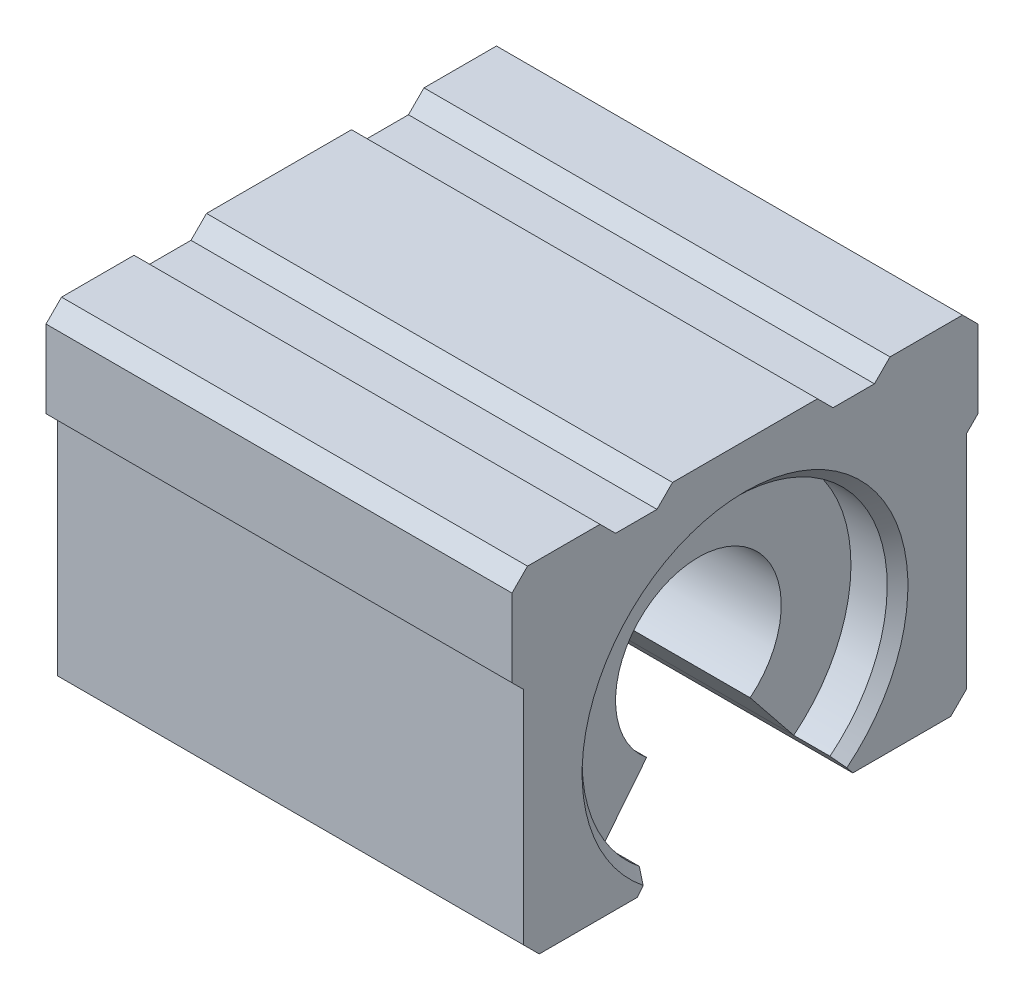
ISO-10303-21;
HEADER;
FILE_DESCRIPTION(('STEP AP214'),'2;1');
FILE_NAME('part.step','',(''),(''),'','','');
FILE_SCHEMA(('AUTOMOTIVE_DESIGN { 1 0 10303 214 1 1 1 1 }'));
ENDSEC;
DATA;
#1=APPLICATION_CONTEXT('core data for automotive mechanical design processes');
#2=APPLICATION_PROTOCOL_DEFINITION('international standard','automotive_design',2000,#1);
#3=PRODUCT_CONTEXT('',#1,'mechanical');
#4=PRODUCT('Part','Part','',(#3));
#5=PRODUCT_RELATED_PRODUCT_CATEGORY('part','',(#4));
#6=PRODUCT_DEFINITION_FORMATION('','',#4);
#7=PRODUCT_DEFINITION_CONTEXT('part definition',#1,'design');
#8=PRODUCT_DEFINITION('design','',#6,#7);
#9=PRODUCT_DEFINITION_SHAPE('','',#8);
#10=(LENGTH_UNIT() NAMED_UNIT(*) SI_UNIT(.MILLI.,.METRE.));
#11=(NAMED_UNIT(*) PLANE_ANGLE_UNIT() SI_UNIT($,.RADIAN.));
#12=(NAMED_UNIT(*) SI_UNIT($,.STERADIAN.) SOLID_ANGLE_UNIT());
#13=UNCERTAINTY_MEASURE_WITH_UNIT(LENGTH_MEASURE(1.E-05),#10,'distance_accuracy_value','');
#14=(GEOMETRIC_REPRESENTATION_CONTEXT(3) GLOBAL_UNCERTAINTY_ASSIGNED_CONTEXT((#13)) GLOBAL_UNIT_ASSIGNED_CONTEXT((#10,
#11,#12)) REPRESENTATION_CONTEXT('',''));
#15=CARTESIAN_POINT('',(0.,0.,0.));
#16=DIRECTION('',(0.,0.,1.));
#17=DIRECTION('',(1.,0.,0.));
#18=AXIS2_PLACEMENT_3D('',#15,#16,#17);
#19=CARTESIAN_POINT('',(40.5,0.,0.));
#20=DIRECTION('',(1.,0.,0.));
#21=DIRECTION('',(0.,0.,-1.));
#22=AXIS2_PLACEMENT_3D('',#19,#20,#21);
#23=PLANE('',#22);
#24=CARTESIAN_POINT('',(40.5,0.,0.));
#25=DIRECTION('',(1.,0.,0.));
#26=DIRECTION('',(0.,0.,-1.));
#27=AXIS2_PLACEMENT_3D('',#24,#25,#26);
#28=CIRCLE('',#27,8.);
#29=CARTESIAN_POINT('',(40.5,-6.2449979983984,5.));
#30=VERTEX_POINT('',#29);
#31=CARTESIAN_POINT('',(40.5,-6.24984510039076,-4.99393994969118));
#32=VERTEX_POINT('',#31);
#33=EDGE_CURVE('E60',#30,#32,#28,.F.);
#34=ORIENTED_EDGE('',*,*,#33,.T.);
#35=DIRECTION('',(0.,-0.779903763932189,-0.625899447998162));
#36=VECTOR('',#35,1.);
#37=CARTESIAN_POINT('',(40.5,-0.0106290462028952,0.0132443528543765));
#38=LINE('',#37,#36);
#39=CARTESIAN_POINT('',(40.5,-11.5,-9.20736884379251));
#40=VERTEX_POINT('',#39);
#41=EDGE_CURVE('E554',#32,#40,#38,.T.);
#42=ORIENTED_EDGE('',*,*,#41,.T.);
#43=CARTESIAN_POINT('',(40.5,0.,0.));
#44=DIRECTION('',(1.,0.,0.));
#45=DIRECTION('',(0.,0.,-1.));
#46=AXIS2_PLACEMENT_3D('',#43,#44,#45);
#47=CIRCLE('',#46,14.731790150068);
#48=CARTESIAN_POINT('',(40.5,-11.5,9.20736884379251));
#49=VERTEX_POINT('',#48);
#50=EDGE_CURVE('E265',#40,#49,#47,.T.);
#51=ORIENTED_EDGE('',*,*,#50,.T.);
#52=DIRECTION('',(0.,0.7806247497998,-0.625));
#53=VECTOR('',#52,1.);
#54=CARTESIAN_POINT('',(40.5,0.,0.));
#55=LINE('',#54,#53);
#56=EDGE_CURVE('E253',#49,#30,#55,.T.);
#57=ORIENTED_EDGE('',*,*,#56,.T.);
#58=EDGE_LOOP('',(#34,#42,#51,#57));
#59=FACE_BOUND('',#58,.T.);
#60=ADVANCED_FACE('F43',(#59),#23,.T.);
#61=CARTESIAN_POINT('',(45.,18.5,22.5));
#62=DIRECTION('',(0.,0.707106781186547,0.707106781186547));
#63=DIRECTION('',(0.,-0.707106781186548,0.707106781186548));
#64=AXIS2_PLACEMENT_3D('',#61,#62,#63);
#65=PLANE('',#64);
#66=DIRECTION('',(0.,0.707106781186547,-0.707106781186547));
#67=VECTOR('',#66,1.);
#68=CARTESIAN_POINT('',(0.,18.5,22.5));
#69=LINE('',#68,#67);
#70=CARTESIAN_POINT('',(0.,18.5,22.5));
#71=VERTEX_POINT('',#70);
#72=CARTESIAN_POINT('',(0.,20.,21.));
#73=VERTEX_POINT('',#72);
#74=EDGE_CURVE('E270',#71,#73,#69,.T.);
#75=ORIENTED_EDGE('',*,*,#74,.F.);
#76=DIRECTION('',(-1.,0.,0.));
#77=VECTOR('',#76,1.);
#78=CARTESIAN_POINT('',(45.,18.5,22.5));
#79=LINE('',#78,#77);
#80=CARTESIAN_POINT('',(45.,18.5,22.5));
#81=VERTEX_POINT('',#80);
#82=EDGE_CURVE('E447',#81,#71,#79,.T.);
#83=ORIENTED_EDGE('',*,*,#82,.F.);
#84=DIRECTION('',(0.,0.707106781186547,-0.707106781186547));
#85=VECTOR('',#84,1.);
#86=CARTESIAN_POINT('',(45.,18.5,22.5));
#87=LINE('',#86,#85);
#88=CARTESIAN_POINT('',(45.,20.,21.));
#89=VERTEX_POINT('',#88);
#90=EDGE_CURVE('E280',#81,#89,#87,.T.);
#91=ORIENTED_EDGE('',*,*,#90,.T.);
#92=DIRECTION('',(-1.,0.,0.));
#93=VECTOR('',#92,1.);
#94=CARTESIAN_POINT('',(45.,20.,21.));
#95=LINE('',#94,#93);
#96=EDGE_CURVE('E364',#89,#73,#95,.T.);
#97=ORIENTED_EDGE('',*,*,#96,.T.);
#98=EDGE_LOOP('',(#75,#83,#91,#97));
#99=FACE_BOUND('',#98,.T.);
#100=ADVANCED_FACE('F589',(#99),#65,.T.);
#101=CARTESIAN_POINT('',(45.,18.5,22.5));
#102=DIRECTION('',(0.,0.,-1.));
#103=DIRECTION('',(-1.,0.,0.));
#104=AXIS2_PLACEMENT_3D('',#101,#102,#103);
#105=PLANE('',#104);
#106=DIRECTION('',(0.,-1.,0.));
#107=VECTOR('',#106,1.);
#108=CARTESIAN_POINT('',(0.,18.5,22.5));
#109=LINE('',#108,#107);
#110=CARTESIAN_POINT('',(0.,11.,22.5));
#111=VERTEX_POINT('',#110);
#112=EDGE_CURVE('E285',#71,#111,#109,.T.);
#113=ORIENTED_EDGE('',*,*,#112,.T.);
#114=DIRECTION('',(-1.,0.,0.));
#115=VECTOR('',#114,1.);
#116=CARTESIAN_POINT('',(45.,11.,22.5));
#117=LINE('',#116,#115);
#118=CARTESIAN_POINT('',(45.,11.,22.5));
#119=VERTEX_POINT('',#118);
#120=EDGE_CURVE('E451',#119,#111,#117,.T.);
#121=ORIENTED_EDGE('',*,*,#120,.F.);
#122=DIRECTION('',(0.,-1.,0.));
#123=VECTOR('',#122,1.);
#124=CARTESIAN_POINT('',(45.,18.5,22.5));
#125=LINE('',#124,#123);
#126=EDGE_CURVE('E362',#81,#119,#125,.T.);
#127=ORIENTED_EDGE('',*,*,#126,.F.);
#128=ORIENTED_EDGE('',*,*,#82,.T.);
#129=EDGE_LOOP('',(#113,#121,#127,#128));
#130=FACE_BOUND('',#129,.T.);
#131=ADVANCED_FACE('F593',(#130),#105,.F.);
#132=CARTESIAN_POINT('',(45.,11.,22.5));
#133=DIRECTION('',(0.,0.707106781186556,-0.707106781186539));
#134=DIRECTION('',(0.,0.707106781186539,0.707106781186556));
#135=AXIS2_PLACEMENT_3D('',#132,#133,#134);
#136=PLANE('',#135);
#137=DIRECTION('',(0.,-0.707106781186539,-0.707106781186556));
#138=VECTOR('',#137,1.);
#139=CARTESIAN_POINT('',(0.,11.,22.5));
#140=LINE('',#139,#138);
#141=CARTESIAN_POINT('',(0.,9.86862915010154,21.3686291501015));
#142=VERTEX_POINT('',#141);
#143=EDGE_CURVE('E442',#111,#142,#140,.T.);
#144=ORIENTED_EDGE('',*,*,#143,.T.);
#145=DIRECTION('',(-1.,0.,0.));
#146=VECTOR('',#145,1.);
#147=CARTESIAN_POINT('',(45.,9.86862915010154,21.3686291501015));
#148=LINE('',#147,#146);
#149=CARTESIAN_POINT('',(45.,9.86862915010154,21.3686291501015));
#150=VERTEX_POINT('',#149);
#151=EDGE_CURVE('E455',#150,#142,#148,.T.);
#152=ORIENTED_EDGE('',*,*,#151,.F.);
#153=DIRECTION('',(0.,-0.707106781186539,-0.707106781186556));
#154=VECTOR('',#153,1.);
#155=CARTESIAN_POINT('',(45.,11.,22.5));
#156=LINE('',#155,#154);
#157=EDGE_CURVE('E359',#119,#150,#156,.T.);
#158=ORIENTED_EDGE('',*,*,#157,.F.);
#159=ORIENTED_EDGE('',*,*,#120,.T.);
#160=EDGE_LOOP('',(#144,#152,#158,#159));
#161=FACE_BOUND('',#160,.T.);
#162=ADVANCED_FACE('F615',(#161),#136,.F.);
#163=CARTESIAN_POINT('',(45.,9.86862915010154,21.3686291501015));
#164=DIRECTION('',(0.,0.,-1.));
#165=DIRECTION('',(-1.,0.,0.));
#166=AXIS2_PLACEMENT_3D('',#163,#164,#165);
#167=PLANE('',#166);
#168=DIRECTION('',(0.,-1.,0.));
#169=VECTOR('',#168,1.);
#170=CARTESIAN_POINT('',(0.,9.86862915010154,21.3686291501015));
#171=LINE('',#170,#169);
#172=CARTESIAN_POINT('',(0.,-11.5,21.3686291501015));
#173=VERTEX_POINT('',#172);
#174=EDGE_CURVE('E439',#142,#173,#171,.T.);
#175=ORIENTED_EDGE('',*,*,#174,.T.);
#176=DIRECTION('',(-1.,0.,0.));
#177=VECTOR('',#176,1.);
#178=CARTESIAN_POINT('',(45.,-11.5,21.3686291501015));
#179=LINE('',#178,#177);
#180=CARTESIAN_POINT('',(45.,-11.5,21.3686291501015));
#181=VERTEX_POINT('',#180);
#182=EDGE_CURVE('E459',#181,#173,#179,.T.);
#183=ORIENTED_EDGE('',*,*,#182,.F.);
#184=DIRECTION('',(0.,-1.,0.));
#185=VECTOR('',#184,1.);
#186=CARTESIAN_POINT('',(45.,9.86862915010154,21.3686291501015));
#187=LINE('',#186,#185);
#188=EDGE_CURVE('E356',#150,#181,#187,.T.);
#189=ORIENTED_EDGE('',*,*,#188,.F.);
#190=ORIENTED_EDGE('',*,*,#151,.T.);
#191=EDGE_LOOP('',(#175,#183,#189,#190));
#192=FACE_BOUND('',#191,.T.);
#193=ADVANCED_FACE('F619',(#192),#167,.F.);
#194=CARTESIAN_POINT('',(45.,-11.5,21.3686291501015));
#195=DIRECTION('',(0.,0.707106781186548,-0.707106781186547));
#196=DIRECTION('',(0.,0.707106781186547,0.707106781186548));
#197=AXIS2_PLACEMENT_3D('',#194,#195,#196);
#198=PLANE('',#197);
#199=DIRECTION('',(0.,-0.707106781186547,-0.707106781186548));
#200=VECTOR('',#199,1.);
#201=CARTESIAN_POINT('',(0.,-11.5,21.3686291501015));
#202=LINE('',#201,#200);
#203=CARTESIAN_POINT('',(0.,-13.,19.8686291501015));
#204=VERTEX_POINT('',#203);
#205=EDGE_CURVE('E435',#173,#204,#202,.T.);
#206=ORIENTED_EDGE('',*,*,#205,.T.);
#207=DIRECTION('',(-1.,0.,0.));
#208=VECTOR('',#207,1.);
#209=CARTESIAN_POINT('',(45.,-13.,19.8686291501015));
#210=LINE('',#209,#208);
#211=CARTESIAN_POINT('',(45.,-13.,19.8686291501015));
#212=VERTEX_POINT('',#211);
#213=EDGE_CURVE('E463',#212,#204,#210,.T.);
#214=ORIENTED_EDGE('',*,*,#213,.F.);
#215=DIRECTION('',(0.,-0.707106781186547,-0.707106781186548));
#216=VECTOR('',#215,1.);
#217=CARTESIAN_POINT('',(45.,-11.5,21.3686291501015));
#218=LINE('',#217,#216);
#219=EDGE_CURVE('E353',#181,#212,#218,.T.);
#220=ORIENTED_EDGE('',*,*,#219,.F.);
#221=ORIENTED_EDGE('',*,*,#182,.T.);
#222=EDGE_LOOP('',(#206,#214,#220,#221));
#223=FACE_BOUND('',#222,.T.);
#224=ADVANCED_FACE('F623',(#223),#198,.F.);
#225=CARTESIAN_POINT('',(45.,-13.,10.4083299973307));
#226=DIRECTION('',(0.,-1.,0.));
#227=DIRECTION('',(0.,0.,-1.));
#228=AXIS2_PLACEMENT_3D('',#225,#226,#227);
#229=PLANE('',#228);
#230=DIRECTION('',(0.,0.,1.));
#231=VECTOR('',#230,1.);
#232=CARTESIAN_POINT('',(0.,-13.,10.4083299973307));
#233=LINE('',#232,#231);
#234=CARTESIAN_POINT('',(0.,-13.,10.4083299973307));
#235=VERTEX_POINT('',#234);
#236=EDGE_CURVE('E431',#235,#204,#233,.T.);
#237=ORIENTED_EDGE('',*,*,#236,.F.);
#238=DIRECTION('',(-1.,0.,0.));
#239=VECTOR('',#238,1.);
#240=CARTESIAN_POINT('',(45.,-13.,10.4083299973307));
#241=LINE('',#240,#239);
#242=CARTESIAN_POINT('',(45.,-13.,10.4083299973307));
#243=VERTEX_POINT('',#242);
#244=EDGE_CURVE('E466',#243,#235,#241,.T.);
#245=ORIENTED_EDGE('',*,*,#244,.F.);
#246=DIRECTION('',(0.,0.,1.));
#247=VECTOR('',#246,1.);
#248=CARTESIAN_POINT('',(45.,-13.,10.4083299973307));
#249=LINE('',#248,#247);
#250=EDGE_CURVE('E349',#243,#212,#249,.T.);
#251=ORIENTED_EDGE('',*,*,#250,.T.);
#252=ORIENTED_EDGE('',*,*,#213,.T.);
#253=EDGE_LOOP('',(#237,#245,#251,#252));
#254=FACE_BOUND('',#253,.T.);
#255=ADVANCED_FACE('F627',(#254),#229,.T.);
#256=CARTESIAN_POINT('',(45.,-13.,10.4083299973307));
#257=DIRECTION('',(0.,0.625,0.7806247497998));
#258=DIRECTION('',(0.,-0.7806247497998,0.625));
#259=AXIS2_PLACEMENT_3D('',#256,#257,#258);
#260=PLANE('',#259);
#261=DIRECTION('',(0.,0.7806247497998,-0.625));
#262=VECTOR('',#261,1.);
#263=CARTESIAN_POINT('',(0.,-13.,10.4083299973307));
#264=LINE('',#263,#262);
#265=CARTESIAN_POINT('',(0.,-12.2806247497998,9.83236884379252));
#266=VERTEX_POINT('',#265);
#267=EDGE_CURVE('E428',#235,#266,#264,.T.);
#268=ORIENTED_EDGE('',*,*,#267,.T.);
#269=DIRECTION('',(0.707106781186548,0.55198505414549,-0.441941738241592));
#270=VECTOR('',#269,1.);
#271=CARTESIAN_POINT('',(15.7317901500681,0.,0.));
#272=LINE('',#271,#270);
#273=CARTESIAN_POINT('',(1.00000000000001,-11.5,9.20736884379251));
#274=VERTEX_POINT('',#273);
#275=EDGE_CURVE('E11',#266,#274,#272,.T.);
#276=ORIENTED_EDGE('',*,*,#275,.T.);
#277=DIRECTION('',(-1.,0.,0.));
#278=VECTOR('',#277,1.);
#279=CARTESIAN_POINT('',(4.5,-11.5,9.20736884379251));
#280=LINE('',#279,#278);
#281=CARTESIAN_POINT('',(4.5,-11.5,9.20736884379251));
#282=VERTEX_POINT('',#281);
#283=EDGE_CURVE('E260',#282,#274,#280,.T.);
#284=ORIENTED_EDGE('',*,*,#283,.F.);
#285=DIRECTION('',(0.,0.7806247497998,-0.625));
#286=VECTOR('',#285,1.);
#287=CARTESIAN_POINT('',(4.5,0.,0.));
#288=LINE('',#287,#286);
#289=CARTESIAN_POINT('',(4.5,-6.2449979983984,5.));
#290=VERTEX_POINT('',#289);
#291=EDGE_CURVE('E243',#282,#290,#288,.T.);
#292=ORIENTED_EDGE('',*,*,#291,.T.);
#293=DIRECTION('',(1.,0.,0.));
#294=VECTOR('',#293,1.);
#295=CARTESIAN_POINT('',(-22.3207487610351,-6.2449979983984,5.));
#296=LINE('',#295,#294);
#297=EDGE_CURVE('E569',#290,#30,#296,.T.);
#298=ORIENTED_EDGE('',*,*,#297,.T.);
#299=ORIENTED_EDGE('',*,*,#56,.F.);
#300=DIRECTION('',(-1.,0.,0.));
#301=VECTOR('',#300,1.);
#302=CARTESIAN_POINT('',(45.,-11.5,9.20736884379251));
#303=LINE('',#302,#301);
#304=CARTESIAN_POINT('',(44.,-11.5,9.20736884379251));
#305=VERTEX_POINT('',#304);
#306=EDGE_CURVE('E469',#305,#49,#303,.T.);
#307=ORIENTED_EDGE('',*,*,#306,.F.);
#308=DIRECTION('',(0.707106781186542,-0.551985054145495,0.441941738241596));
#309=VECTOR('',#308,1.);
#310=CARTESIAN_POINT('',(29.2682098499322,0.,0.));
#311=LINE('',#310,#309);
#312=CARTESIAN_POINT('',(45.,-12.2806247497998,9.83236884379251));
#313=VERTEX_POINT('',#312);
#314=EDGE_CURVE('E529',#305,#313,#311,.T.);
#315=ORIENTED_EDGE('',*,*,#314,.T.);
#316=DIRECTION('',(0.,0.7806247497998,-0.625));
#317=VECTOR('',#316,1.);
#318=CARTESIAN_POINT('',(45.,-13.,10.4083299973307));
#319=LINE('',#318,#317);
#320=EDGE_CURVE('E345',#243,#313,#319,.T.);
#321=ORIENTED_EDGE('',*,*,#320,.F.);
#322=ORIENTED_EDGE('',*,*,#244,.T.);
#323=EDGE_LOOP('',(#268,#276,#284,#292,#298,#299,#307,#315,#321,#322));
#324=FACE_BOUND('',#323,.T.);
#325=ADVANCED_FACE('F267',(#324),#260,.F.);
#326=CARTESIAN_POINT('',(45.,-11.5,-9.20736884379251));
#327=DIRECTION('',(0.,0.625,-0.7806247497998));
#328=DIRECTION('',(0.,0.7806247497998,0.625));
#329=AXIS2_PLACEMENT_3D('',#326,#327,#328);
#330=PLANE('',#329);
#331=DIRECTION('',(-1.,0.,0.));
#332=VECTOR('',#331,1.);
#333=CARTESIAN_POINT('',(4.5,-11.5,-9.20736884379251));
#334=LINE('',#333,#332);
#335=CARTESIAN_POINT('',(4.5,-11.5,-9.20736884379251));
#336=VERTEX_POINT('',#335);
#337=CARTESIAN_POINT('',(1.00000000000001,-11.5,-9.20736884379251));
#338=VERTEX_POINT('',#337);
#339=EDGE_CURVE('E263',#336,#338,#334,.T.);
#340=ORIENTED_EDGE('',*,*,#339,.T.);
#341=DIRECTION('',(-0.707106781186548,-0.55198505414549,-0.441941738241592));
#342=VECTOR('',#341,1.);
#343=CARTESIAN_POINT('',(15.7317901500681,0.,0.));
#344=LINE('',#343,#342);
#345=CARTESIAN_POINT('',(0.,-12.2806247497998,-9.83236884379252));
#346=VERTEX_POINT('',#345);
#347=EDGE_CURVE('E541',#338,#346,#344,.T.);
#348=ORIENTED_EDGE('',*,*,#347,.T.);
#349=DIRECTION('',(0.,-0.7806247497998,-0.625));
#350=VECTOR('',#349,1.);
#351=CARTESIAN_POINT('',(0.,-11.5,-9.20736884379251));
#352=LINE('',#351,#350);
#353=CARTESIAN_POINT('',(0.,-13.,-10.4083299973307));
#354=VERTEX_POINT('',#353);
#355=EDGE_CURVE('E425',#346,#354,#352,.T.);
#356=ORIENTED_EDGE('',*,*,#355,.T.);
#357=DIRECTION('',(-1.,0.,0.));
#358=VECTOR('',#357,1.);
#359=CARTESIAN_POINT('',(45.,-13.,-10.4083299973307));
#360=LINE('',#359,#358);
#361=CARTESIAN_POINT('',(45.,-13.,-10.4083299973307));
#362=VERTEX_POINT('',#361);
#363=EDGE_CURVE('E478',#362,#354,#360,.T.);
#364=ORIENTED_EDGE('',*,*,#363,.F.);
#365=DIRECTION('',(0.,-0.7806247497998,-0.625));
#366=VECTOR('',#365,1.);
#367=CARTESIAN_POINT('',(45.,-11.5,-9.20736884379251));
#368=LINE('',#367,#366);
#369=CARTESIAN_POINT('',(45.,-12.2806247497998,-9.83236884379251));
#370=VERTEX_POINT('',#369);
#371=EDGE_CURVE('E342',#370,#362,#368,.T.);
#372=ORIENTED_EDGE('',*,*,#371,.F.);
#373=DIRECTION('',(-0.707106781186542,0.551985054145495,0.441941738241596));
#374=VECTOR('',#373,1.);
#375=CARTESIAN_POINT('',(29.2682098499322,0.,0.));
#376=LINE('',#375,#374);
#377=CARTESIAN_POINT('',(44.,-11.5,-9.20736884379251));
#378=VERTEX_POINT('',#377);
#379=EDGE_CURVE('E535',#370,#378,#376,.T.);
#380=ORIENTED_EDGE('',*,*,#379,.T.);
#381=DIRECTION('',(-1.,0.,0.));
#382=VECTOR('',#381,1.);
#383=CARTESIAN_POINT('',(45.,-11.5,-9.20736884379251));
#384=LINE('',#383,#382);
#385=EDGE_CURVE('E473',#378,#40,#384,.T.);
#386=ORIENTED_EDGE('',*,*,#385,.T.);
#387=EDGE_CURVE('E477',#40,#336,#384,.T.);
#388=ORIENTED_EDGE('',*,*,#387,.T.);
#389=EDGE_LOOP('',(#340,#348,#356,#364,#372,#380,#386,#388));
#390=FACE_BOUND('',#389,.T.);
#391=ADVANCED_FACE('F547',(#390),#330,.F.);
#392=CARTESIAN_POINT('',(45.,-13.,-19.8686291501015));
#393=DIRECTION('',(0.,-1.,0.));
#394=DIRECTION('',(0.,0.,-1.));
#395=AXIS2_PLACEMENT_3D('',#392,#393,#394);
#396=PLANE('',#395);
#397=DIRECTION('',(0.,0.,1.));
#398=VECTOR('',#397,1.);
#399=CARTESIAN_POINT('',(0.,-13.,-19.8686291501015));
#400=LINE('',#399,#398);
#401=CARTESIAN_POINT('',(0.,-13.,-19.8686291501015));
#402=VERTEX_POINT('',#401);
#403=EDGE_CURVE('E421',#402,#354,#400,.T.);
#404=ORIENTED_EDGE('',*,*,#403,.F.);
#405=DIRECTION('',(-1.,0.,0.));
#406=VECTOR('',#405,1.);
#407=CARTESIAN_POINT('',(45.,-13.,-19.8686291501015));
#408=LINE('',#407,#406);
#409=CARTESIAN_POINT('',(45.,-13.,-19.8686291501015));
#410=VERTEX_POINT('',#409);
#411=EDGE_CURVE('E482',#410,#402,#408,.T.);
#412=ORIENTED_EDGE('',*,*,#411,.F.);
#413=DIRECTION('',(0.,0.,1.));
#414=VECTOR('',#413,1.);
#415=CARTESIAN_POINT('',(45.,-13.,-19.8686291501015));
#416=LINE('',#415,#414);
#417=EDGE_CURVE('E338',#410,#362,#416,.T.);
#418=ORIENTED_EDGE('',*,*,#417,.T.);
#419=ORIENTED_EDGE('',*,*,#363,.T.);
#420=EDGE_LOOP('',(#404,#412,#418,#419));
#421=FACE_BOUND('',#420,.T.);
#422=ADVANCED_FACE('F636',(#421),#396,.T.);
#423=CARTESIAN_POINT('',(45.,-11.5,-21.3686291501015));
#424=DIRECTION('',(0.,-0.707106781186548,-0.707106781186547));
#425=DIRECTION('',(0.,0.707106781186547,-0.707106781186548));
#426=AXIS2_PLACEMENT_3D('',#423,#424,#425);
#427=PLANE('',#426);
#428=DIRECTION('',(0.,-0.707106781186547,0.707106781186548));
#429=VECTOR('',#428,1.);
#430=CARTESIAN_POINT('',(0.,-11.5,-21.3686291501015));
#431=LINE('',#430,#429);
#432=CARTESIAN_POINT('',(0.,-11.5,-21.3686291501015));
#433=VERTEX_POINT('',#432);
#434=EDGE_CURVE('E417',#433,#402,#431,.T.);
#435=ORIENTED_EDGE('',*,*,#434,.F.);
#436=DIRECTION('',(-1.,0.,0.));
#437=VECTOR('',#436,1.);
#438=CARTESIAN_POINT('',(45.,-11.5,-21.3686291501015));
#439=LINE('',#438,#437);
#440=CARTESIAN_POINT('',(45.,-11.5,-21.3686291501015));
#441=VERTEX_POINT('',#440);
#442=EDGE_CURVE('E485',#441,#433,#439,.T.);
#443=ORIENTED_EDGE('',*,*,#442,.F.);
#444=DIRECTION('',(0.,-0.707106781186547,0.707106781186548));
#445=VECTOR('',#444,1.);
#446=CARTESIAN_POINT('',(45.,-11.5,-21.3686291501015));
#447=LINE('',#446,#445);
#448=EDGE_CURVE('E334',#441,#410,#447,.T.);
#449=ORIENTED_EDGE('',*,*,#448,.T.);
#450=ORIENTED_EDGE('',*,*,#411,.T.);
#451=EDGE_LOOP('',(#435,#443,#449,#450));
#452=FACE_BOUND('',#451,.T.);
#453=ADVANCED_FACE('F639',(#452),#427,.T.);
#454=CARTESIAN_POINT('',(45.,9.86862915010154,-21.3686291501016));
#455=DIRECTION('',(0.,0.,-1.));
#456=DIRECTION('',(0.,1.,0.));
#457=AXIS2_PLACEMENT_3D('',#454,#455,#456);
#458=PLANE('',#457);
#459=DIRECTION('',(0.,-1.,0.));
#460=VECTOR('',#459,1.);
#461=CARTESIAN_POINT('',(0.,9.86862915010154,-21.3686291501016));
#462=LINE('',#461,#460);
#463=CARTESIAN_POINT('',(0.,9.86862915010154,-21.3686291501016));
#464=VERTEX_POINT('',#463);
#465=EDGE_CURVE('E413',#464,#433,#462,.T.);
#466=ORIENTED_EDGE('',*,*,#465,.F.);
#467=DIRECTION('',(-1.,0.,0.));
#468=VECTOR('',#467,1.);
#469=CARTESIAN_POINT('',(45.,9.86862915010154,-21.3686291501016));
#470=LINE('',#469,#468);
#471=CARTESIAN_POINT('',(45.,9.86862915010154,-21.3686291501016));
#472=VERTEX_POINT('',#471);
#473=EDGE_CURVE('E488',#472,#464,#470,.T.);
#474=ORIENTED_EDGE('',*,*,#473,.F.);
#475=DIRECTION('',(0.,-1.,0.));
#476=VECTOR('',#475,1.);
#477=CARTESIAN_POINT('',(45.,9.86862915010154,-21.3686291501016));
#478=LINE('',#477,#476);
#479=EDGE_CURVE('E330',#472,#441,#478,.T.);
#480=ORIENTED_EDGE('',*,*,#479,.T.);
#481=ORIENTED_EDGE('',*,*,#442,.T.);
#482=EDGE_LOOP('',(#466,#474,#480,#481));
#483=FACE_BOUND('',#482,.T.);
#484=ADVANCED_FACE('F643',(#483),#458,.T.);
#485=CARTESIAN_POINT('',(45.,11.,-22.5));
#486=DIRECTION('',(0.,-0.707106781186542,-0.707106781186553));
#487=DIRECTION('',(0.,0.707106781186553,-0.707106781186542));
#488=AXIS2_PLACEMENT_3D('',#485,#486,#487);
#489=PLANE('',#488);
#490=DIRECTION('',(0.,-0.707106781186553,0.707106781186542));
#491=VECTOR('',#490,1.);
#492=CARTESIAN_POINT('',(0.,11.,-22.5));
#493=LINE('',#492,#491);
#494=CARTESIAN_POINT('',(0.,11.,-22.5));
#495=VERTEX_POINT('',#494);
#496=EDGE_CURVE('E409',#495,#464,#493,.T.);
#497=ORIENTED_EDGE('',*,*,#496,.F.);
#498=DIRECTION('',(-1.,0.,0.));
#499=VECTOR('',#498,1.);
#500=CARTESIAN_POINT('',(45.,11.,-22.5));
#501=LINE('',#500,#499);
#502=CARTESIAN_POINT('',(45.,11.,-22.5));
#503=VERTEX_POINT('',#502);
#504=EDGE_CURVE('E491',#503,#495,#501,.T.);
#505=ORIENTED_EDGE('',*,*,#504,.F.);
#506=DIRECTION('',(0.,-0.707106781186553,0.707106781186542));
#507=VECTOR('',#506,1.);
#508=CARTESIAN_POINT('',(45.,11.,-22.5));
#509=LINE('',#508,#507);
#510=EDGE_CURVE('E326',#503,#472,#509,.T.);
#511=ORIENTED_EDGE('',*,*,#510,.T.);
#512=ORIENTED_EDGE('',*,*,#473,.T.);
#513=EDGE_LOOP('',(#497,#505,#511,#512));
#514=FACE_BOUND('',#513,.T.);
#515=ADVANCED_FACE('F647',(#514),#489,.T.);
#516=CARTESIAN_POINT('',(45.,18.5,-22.5));
#517=DIRECTION('',(0.,0.,-1.));
#518=DIRECTION('',(-1.,0.,0.));
#519=AXIS2_PLACEMENT_3D('',#516,#517,#518);
#520=PLANE('',#519);
#521=DIRECTION('',(0.,-1.,0.));
#522=VECTOR('',#521,1.);
#523=CARTESIAN_POINT('',(0.,18.5,-22.5));
#524=LINE('',#523,#522);
#525=CARTESIAN_POINT('',(0.,18.5,-22.5));
#526=VERTEX_POINT('',#525);
#527=EDGE_CURVE('E405',#526,#495,#524,.T.);
#528=ORIENTED_EDGE('',*,*,#527,.F.);
#529=DIRECTION('',(-1.,0.,0.));
#530=VECTOR('',#529,1.);
#531=CARTESIAN_POINT('',(45.,18.5,-22.5));
#532=LINE('',#531,#530);
#533=CARTESIAN_POINT('',(45.,18.5,-22.5));
#534=VERTEX_POINT('',#533);
#535=EDGE_CURVE('E494',#534,#526,#532,.T.);
#536=ORIENTED_EDGE('',*,*,#535,.F.);
#537=DIRECTION('',(0.,-1.,0.));
#538=VECTOR('',#537,1.);
#539=CARTESIAN_POINT('',(45.,18.5,-22.5));
#540=LINE('',#539,#538);
#541=EDGE_CURVE('E322',#534,#503,#540,.T.);
#542=ORIENTED_EDGE('',*,*,#541,.T.);
#543=ORIENTED_EDGE('',*,*,#504,.T.);
#544=EDGE_LOOP('',(#528,#536,#542,#543));
#545=FACE_BOUND('',#544,.T.);
#546=ADVANCED_FACE('F651',(#545),#520,.T.);
#547=CARTESIAN_POINT('',(45.,18.5,-22.5));
#548=DIRECTION('',(0.,-0.707106781186547,0.707106781186547));
#549=DIRECTION('',(0.,-0.707106781186548,-0.707106781186548));
#550=AXIS2_PLACEMENT_3D('',#547,#548,#549);
#551=PLANE('',#550);
#552=DIRECTION('',(0.,0.707106781186547,0.707106781186547));
#553=VECTOR('',#552,1.);
#554=CARTESIAN_POINT('',(0.,18.5,-22.5));
#555=LINE('',#554,#553);
#556=CARTESIAN_POINT('',(0.,20.,-21.));
#557=VERTEX_POINT('',#556);
#558=EDGE_CURVE('E401',#526,#557,#555,.T.);
#559=ORIENTED_EDGE('',*,*,#558,.T.);
#560=DIRECTION('',(-1.,0.,0.));
#561=VECTOR('',#560,1.);
#562=CARTESIAN_POINT('',(45.,20.,-21.));
#563=LINE('',#562,#561);
#564=CARTESIAN_POINT('',(45.,20.,-21.));
#565=VERTEX_POINT('',#564);
#566=EDGE_CURVE('E497',#565,#557,#563,.T.);
#567=ORIENTED_EDGE('',*,*,#566,.F.);
#568=DIRECTION('',(0.,0.707106781186547,0.707106781186547));
#569=VECTOR('',#568,1.);
#570=CARTESIAN_POINT('',(45.,18.5,-22.5));
#571=LINE('',#570,#569);
#572=EDGE_CURVE('E319',#534,#565,#571,.T.);
#573=ORIENTED_EDGE('',*,*,#572,.F.);
#574=ORIENTED_EDGE('',*,*,#535,.T.);
#575=EDGE_LOOP('',(#559,#567,#573,#574));
#576=FACE_BOUND('',#575,.T.);
#577=ADVANCED_FACE('F655',(#576),#551,.F.);
#578=CARTESIAN_POINT('',(45.,20.,-14.));
#579=DIRECTION('',(0.,1.,0.));
#580=DIRECTION('',(0.,0.,1.));
#581=AXIS2_PLACEMENT_3D('',#578,#579,#580);
#582=PLANE('',#581);
#583=DIRECTION('',(0.,0.,-1.));
#584=VECTOR('',#583,1.);
#585=CARTESIAN_POINT('',(0.,20.,-14.));
#586=LINE('',#585,#584);
#587=CARTESIAN_POINT('',(0.,20.,-14.));
#588=VERTEX_POINT('',#587);
#589=EDGE_CURVE('E397',#588,#557,#586,.T.);
#590=ORIENTED_EDGE('',*,*,#589,.F.);
#591=DIRECTION('',(-1.,0.,0.));
#592=VECTOR('',#591,1.);
#593=CARTESIAN_POINT('',(45.,20.,-14.));
#594=LINE('',#593,#592);
#595=CARTESIAN_POINT('',(45.,20.,-14.));
#596=VERTEX_POINT('',#595);
#597=EDGE_CURVE('E500',#596,#588,#594,.T.);
#598=ORIENTED_EDGE('',*,*,#597,.F.);
#599=DIRECTION('',(0.,0.,-1.));
#600=VECTOR('',#599,1.);
#601=CARTESIAN_POINT('',(45.,20.,-14.));
#602=LINE('',#601,#600);
#603=EDGE_CURVE('E315',#596,#565,#602,.T.);
#604=ORIENTED_EDGE('',*,*,#603,.T.);
#605=ORIENTED_EDGE('',*,*,#566,.T.);
#606=EDGE_LOOP('',(#590,#598,#604,#605));
#607=FACE_BOUND('',#606,.T.);
#608=ADVANCED_FACE('F659',(#607),#582,.T.);
#609=CARTESIAN_POINT('',(45.,20.,-14.));
#610=DIRECTION('',(0.,-0.707106781186541,-0.707106781186554));
#611=DIRECTION('',(0.,0.707106781186554,-0.707106781186541));
#612=AXIS2_PLACEMENT_3D('',#609,#610,#611);
#613=PLANE('',#612);
#614=DIRECTION('',(0.,-0.707106781186554,0.707106781186541));
#615=VECTOR('',#614,1.);
#616=CARTESIAN_POINT('',(0.,20.,-14.));
#617=LINE('',#616,#615);
#618=CARTESIAN_POINT('',(0.,18.5,-12.5));
#619=VERTEX_POINT('',#618);
#620=EDGE_CURVE('E393',#588,#619,#617,.T.);
#621=ORIENTED_EDGE('',*,*,#620,.T.);
#622=DIRECTION('',(-1.,0.,0.));
#623=VECTOR('',#622,1.);
#624=CARTESIAN_POINT('',(45.,18.5,-12.5));
#625=LINE('',#624,#623);
#626=CARTESIAN_POINT('',(45.,18.5,-12.5));
#627=VERTEX_POINT('',#626);
#628=EDGE_CURVE('E503',#627,#619,#625,.T.);
#629=ORIENTED_EDGE('',*,*,#628,.F.);
#630=DIRECTION('',(0.,-0.707106781186554,0.707106781186541));
#631=VECTOR('',#630,1.);
#632=CARTESIAN_POINT('',(45.,20.,-14.));
#633=LINE('',#632,#631);
#634=EDGE_CURVE('E312',#596,#627,#633,.T.);
#635=ORIENTED_EDGE('',*,*,#634,.F.);
#636=ORIENTED_EDGE('',*,*,#597,.T.);
#637=EDGE_LOOP('',(#621,#629,#635,#636));
#638=FACE_BOUND('',#637,.T.);
#639=ADVANCED_FACE('F663',(#638),#613,.F.);
#640=CARTESIAN_POINT('',(45.,18.5,-8.50000000000003));
#641=DIRECTION('',(0.,1.,0.));
#642=DIRECTION('',(0.,0.,1.));
#643=AXIS2_PLACEMENT_3D('',#640,#641,#642);
#644=PLANE('',#643);
#645=DIRECTION('',(0.,0.,-1.));
#646=VECTOR('',#645,1.);
#647=CARTESIAN_POINT('',(0.,18.5,-8.50000000000003));
#648=LINE('',#647,#646);
#649=CARTESIAN_POINT('',(0.,18.5,-8.50000000000003));
#650=VERTEX_POINT('',#649);
#651=EDGE_CURVE('E389',#650,#619,#648,.T.);
#652=ORIENTED_EDGE('',*,*,#651,.F.);
#653=DIRECTION('',(-1.,0.,0.));
#654=VECTOR('',#653,1.);
#655=CARTESIAN_POINT('',(45.,18.5,-8.50000000000003));
#656=LINE('',#655,#654);
#657=CARTESIAN_POINT('',(45.,18.5,-8.50000000000003));
#658=VERTEX_POINT('',#657);
#659=EDGE_CURVE('E506',#658,#650,#656,.T.);
#660=ORIENTED_EDGE('',*,*,#659,.F.);
#661=DIRECTION('',(0.,0.,-1.));
#662=VECTOR('',#661,1.);
#663=CARTESIAN_POINT('',(45.,18.5,-8.50000000000003));
#664=LINE('',#663,#662);
#665=EDGE_CURVE('E308',#658,#627,#664,.T.);
#666=ORIENTED_EDGE('',*,*,#665,.T.);
#667=ORIENTED_EDGE('',*,*,#628,.T.);
#668=EDGE_LOOP('',(#652,#660,#666,#667));
#669=FACE_BOUND('',#668,.T.);
#670=ADVANCED_FACE('F667',(#669),#644,.T.);
#671=CARTESIAN_POINT('',(45.,20.,-7.));
#672=DIRECTION('',(0.,0.707106781186554,-0.707106781186541));
#673=DIRECTION('',(0.,0.707106781186541,0.707106781186554));
#674=AXIS2_PLACEMENT_3D('',#671,#672,#673);
#675=PLANE('',#674);
#676=DIRECTION('',(0.,-0.707106781186541,-0.707106781186554));
#677=VECTOR('',#676,1.);
#678=CARTESIAN_POINT('',(0.,20.,-7.));
#679=LINE('',#678,#677);
#680=CARTESIAN_POINT('',(0.,20.,-7.));
#681=VERTEX_POINT('',#680);
#682=EDGE_CURVE('E385',#681,#650,#679,.T.);
#683=ORIENTED_EDGE('',*,*,#682,.F.);
#684=DIRECTION('',(-1.,0.,0.));
#685=VECTOR('',#684,1.);
#686=CARTESIAN_POINT('',(45.,20.,-7.));
#687=LINE('',#686,#685);
#688=CARTESIAN_POINT('',(45.,20.,-7.));
#689=VERTEX_POINT('',#688);
#690=EDGE_CURVE('E509',#689,#681,#687,.T.);
#691=ORIENTED_EDGE('',*,*,#690,.F.);
#692=DIRECTION('',(0.,-0.707106781186541,-0.707106781186554));
#693=VECTOR('',#692,1.);
#694=CARTESIAN_POINT('',(45.,20.,-7.));
#695=LINE('',#694,#693);
#696=EDGE_CURVE('E304',#689,#658,#695,.T.);
#697=ORIENTED_EDGE('',*,*,#696,.T.);
#698=ORIENTED_EDGE('',*,*,#659,.T.);
#699=EDGE_LOOP('',(#683,#691,#697,#698));
#700=FACE_BOUND('',#699,.T.);
#701=ADVANCED_FACE('F671',(#700),#675,.T.);
#702=CARTESIAN_POINT('',(45.,20.,7.));
#703=DIRECTION('',(0.,1.,0.));
#704=DIRECTION('',(0.,0.,1.));
#705=AXIS2_PLACEMENT_3D('',#702,#703,#704);
#706=PLANE('',#705);
#707=DIRECTION('',(0.,0.,-1.));
#708=VECTOR('',#707,1.);
#709=CARTESIAN_POINT('',(0.,20.,7.));
#710=LINE('',#709,#708);
#711=CARTESIAN_POINT('',(0.,20.,7.));
#712=VERTEX_POINT('',#711);
#713=EDGE_CURVE('E381',#712,#681,#710,.T.);
#714=ORIENTED_EDGE('',*,*,#713,.F.);
#715=DIRECTION('',(-1.,0.,0.));
#716=VECTOR('',#715,1.);
#717=CARTESIAN_POINT('',(45.,20.,7.));
#718=LINE('',#717,#716);
#719=CARTESIAN_POINT('',(45.,20.,7.));
#720=VERTEX_POINT('',#719);
#721=EDGE_CURVE('E512',#720,#712,#718,.T.);
#722=ORIENTED_EDGE('',*,*,#721,.F.);
#723=DIRECTION('',(0.,0.,-1.));
#724=VECTOR('',#723,1.);
#725=CARTESIAN_POINT('',(45.,20.,7.));
#726=LINE('',#725,#724);
#727=EDGE_CURVE('E300',#720,#689,#726,.T.);
#728=ORIENTED_EDGE('',*,*,#727,.T.);
#729=ORIENTED_EDGE('',*,*,#690,.T.);
#730=EDGE_LOOP('',(#714,#722,#728,#729));
#731=FACE_BOUND('',#730,.T.);
#732=ADVANCED_FACE('F675',(#731),#706,.T.);
#733=CARTESIAN_POINT('',(45.,20.,7.));
#734=DIRECTION('',(0.,-0.707106781186538,-0.707106781186557));
#735=DIRECTION('',(0.,0.707106781186557,-0.707106781186538));
#736=AXIS2_PLACEMENT_3D('',#733,#734,#735);
#737=PLANE('',#736);
#738=DIRECTION('',(0.,-0.707106781186557,0.707106781186538));
#739=VECTOR('',#738,1.);
#740=CARTESIAN_POINT('',(0.,20.,7.));
#741=LINE('',#740,#739);
#742=CARTESIAN_POINT('',(0.,18.5,8.49999999999996));
#743=VERTEX_POINT('',#742);
#744=EDGE_CURVE('E377',#712,#743,#741,.T.);
#745=ORIENTED_EDGE('',*,*,#744,.T.);
#746=DIRECTION('',(-1.,0.,0.));
#747=VECTOR('',#746,1.);
#748=CARTESIAN_POINT('',(45.,18.5,8.49999999999996));
#749=LINE('',#748,#747);
#750=CARTESIAN_POINT('',(45.,18.5,8.49999999999996));
#751=VERTEX_POINT('',#750);
#752=EDGE_CURVE('E515',#751,#743,#749,.T.);
#753=ORIENTED_EDGE('',*,*,#752,.F.);
#754=DIRECTION('',(0.,-0.707106781186557,0.707106781186538));
#755=VECTOR('',#754,1.);
#756=CARTESIAN_POINT('',(45.,20.,7.));
#757=LINE('',#756,#755);
#758=EDGE_CURVE('E297',#720,#751,#757,.T.);
#759=ORIENTED_EDGE('',*,*,#758,.F.);
#760=ORIENTED_EDGE('',*,*,#721,.T.);
#761=EDGE_LOOP('',(#745,#753,#759,#760));
#762=FACE_BOUND('',#761,.T.);
#763=ADVANCED_FACE('F679',(#762),#737,.F.);
#764=CARTESIAN_POINT('',(45.,18.5,12.5));
#765=DIRECTION('',(0.,1.,0.));
#766=DIRECTION('',(0.,0.,1.));
#767=AXIS2_PLACEMENT_3D('',#764,#765,#766);
#768=PLANE('',#767);
#769=DIRECTION('',(0.,0.,-1.));
#770=VECTOR('',#769,1.);
#771=CARTESIAN_POINT('',(0.,18.5,12.5));
#772=LINE('',#771,#770);
#773=CARTESIAN_POINT('',(0.,18.5,12.5));
#774=VERTEX_POINT('',#773);
#775=EDGE_CURVE('E373',#774,#743,#772,.T.);
#776=ORIENTED_EDGE('',*,*,#775,.F.);
#777=DIRECTION('',(-1.,0.,0.));
#778=VECTOR('',#777,1.);
#779=CARTESIAN_POINT('',(45.,18.5,12.5));
#780=LINE('',#779,#778);
#781=CARTESIAN_POINT('',(45.,18.5,12.5));
#782=VERTEX_POINT('',#781);
#783=EDGE_CURVE('E518',#782,#774,#780,.T.);
#784=ORIENTED_EDGE('',*,*,#783,.F.);
#785=DIRECTION('',(0.,0.,-1.));
#786=VECTOR('',#785,1.);
#787=CARTESIAN_POINT('',(45.,18.5,12.5));
#788=LINE('',#787,#786);
#789=EDGE_CURVE('E293',#782,#751,#788,.T.);
#790=ORIENTED_EDGE('',*,*,#789,.T.);
#791=ORIENTED_EDGE('',*,*,#752,.T.);
#792=EDGE_LOOP('',(#776,#784,#790,#791));
#793=FACE_BOUND('',#792,.T.);
#794=ADVANCED_FACE('F683',(#793),#768,.T.);
#795=CARTESIAN_POINT('',(45.,20.,14.));
#796=DIRECTION('',(0.,0.707106781186556,-0.707106781186539));
#797=DIRECTION('',(0.,0.707106781186539,0.707106781186556));
#798=AXIS2_PLACEMENT_3D('',#795,#796,#797);
#799=PLANE('',#798);
#800=DIRECTION('',(0.,-0.707106781186539,-0.707106781186556));
#801=VECTOR('',#800,1.);
#802=CARTESIAN_POINT('',(0.,20.,14.));
#803=LINE('',#802,#801);
#804=CARTESIAN_POINT('',(0.,20.,14.));
#805=VERTEX_POINT('',#804);
#806=EDGE_CURVE('E369',#805,#774,#803,.T.);
#807=ORIENTED_EDGE('',*,*,#806,.F.);
#808=DIRECTION('',(-1.,0.,0.));
#809=VECTOR('',#808,1.);
#810=CARTESIAN_POINT('',(45.,20.,14.));
#811=LINE('',#810,#809);
#812=CARTESIAN_POINT('',(45.,20.,14.));
#813=VERTEX_POINT('',#812);
#814=EDGE_CURVE('E521',#813,#805,#811,.T.);
#815=ORIENTED_EDGE('',*,*,#814,.F.);
#816=DIRECTION('',(0.,-0.707106781186539,-0.707106781186556));
#817=VECTOR('',#816,1.);
#818=CARTESIAN_POINT('',(45.,20.,14.));
#819=LINE('',#818,#817);
#820=EDGE_CURVE('E289',#813,#782,#819,.T.);
#821=ORIENTED_EDGE('',*,*,#820,.T.);
#822=ORIENTED_EDGE('',*,*,#783,.T.);
#823=EDGE_LOOP('',(#807,#815,#821,#822));
#824=FACE_BOUND('',#823,.T.);
#825=ADVANCED_FACE('F687',(#824),#799,.T.);
#826=CARTESIAN_POINT('',(45.,20.,21.));
#827=DIRECTION('',(0.,1.,0.));
#828=DIRECTION('',(0.,0.,1.));
#829=AXIS2_PLACEMENT_3D('',#826,#827,#828);
#830=PLANE('',#829);
#831=DIRECTION('',(0.,0.,-1.));
#832=VECTOR('',#831,1.);
#833=CARTESIAN_POINT('',(0.,20.,21.));
#834=LINE('',#833,#832);
#835=EDGE_CURVE('E275',#73,#805,#834,.T.);
#836=ORIENTED_EDGE('',*,*,#835,.F.);
#837=ORIENTED_EDGE('',*,*,#96,.F.);
#838=DIRECTION('',(0.,0.,-1.));
#839=VECTOR('',#838,1.);
#840=CARTESIAN_POINT('',(45.,20.,21.));
#841=LINE('',#840,#839);
#842=EDGE_CURVE('E284',#89,#813,#841,.T.);
#843=ORIENTED_EDGE('',*,*,#842,.T.);
#844=ORIENTED_EDGE('',*,*,#814,.T.);
#845=EDGE_LOOP('',(#836,#837,#843,#844));
#846=FACE_BOUND('',#845,.T.);
#847=ADVANCED_FACE('F609',(#846),#830,.T.);
#848=CARTESIAN_POINT('',(45.,0.,0.));
#849=DIRECTION('',(-1.,0.,0.));
#850=DIRECTION('',(0.,0.,1.));
#851=AXIS2_PLACEMENT_3D('',#848,#849,#850);
#852=PLANE('',#851);
#853=ORIENTED_EDGE('',*,*,#320,.T.);
#854=CARTESIAN_POINT('',(45.,0.,0.));
#855=DIRECTION('',(-1.,0.,0.));
#856=DIRECTION('',(0.,0.,1.));
#857=AXIS2_PLACEMENT_3D('',#854,#855,#856);
#858=CIRCLE('',#857,15.731790150068);
#859=EDGE_CURVE('E532',#313,#370,#858,.T.);
#860=ORIENTED_EDGE('',*,*,#859,.T.);
#861=ORIENTED_EDGE('',*,*,#371,.T.);
#862=ORIENTED_EDGE('',*,*,#417,.F.);
#863=ORIENTED_EDGE('',*,*,#448,.F.);
#864=ORIENTED_EDGE('',*,*,#479,.F.);
#865=ORIENTED_EDGE('',*,*,#510,.F.);
#866=ORIENTED_EDGE('',*,*,#541,.F.);
#867=ORIENTED_EDGE('',*,*,#572,.T.);
#868=ORIENTED_EDGE('',*,*,#603,.F.);
#869=ORIENTED_EDGE('',*,*,#634,.T.);
#870=ORIENTED_EDGE('',*,*,#665,.F.);
#871=ORIENTED_EDGE('',*,*,#696,.F.);
#872=ORIENTED_EDGE('',*,*,#727,.F.);
#873=ORIENTED_EDGE('',*,*,#758,.T.);
#874=ORIENTED_EDGE('',*,*,#789,.F.);
#875=ORIENTED_EDGE('',*,*,#820,.F.);
#876=ORIENTED_EDGE('',*,*,#842,.F.);
#877=ORIENTED_EDGE('',*,*,#90,.F.);
#878=ORIENTED_EDGE('',*,*,#126,.T.);
#879=ORIENTED_EDGE('',*,*,#157,.T.);
#880=ORIENTED_EDGE('',*,*,#188,.T.);
#881=ORIENTED_EDGE('',*,*,#219,.T.);
#882=ORIENTED_EDGE('',*,*,#250,.F.);
#883=EDGE_LOOP('',(#853,#860,#861,#862,#863,#864,#865,#866,#867,#868,#869,#870,#871,#872,#873,
#874,#875,#876,#877,#878,#879,#880,#881,#882));
#884=FACE_BOUND('',#883,.T.);
#885=ADVANCED_FACE('F606',(#884),#852,.F.);
#886=CARTESIAN_POINT('',(0.,0.,0.));
#887=DIRECTION('',(-1.,0.,0.));
#888=DIRECTION('',(0.,0.,1.));
#889=AXIS2_PLACEMENT_3D('',#886,#887,#888);
#890=PLANE('',#889);
#891=ORIENTED_EDGE('',*,*,#355,.F.);
#892=CARTESIAN_POINT('',(0.,0.,0.));
#893=DIRECTION('',(-1.,0.,0.));
#894=DIRECTION('',(0.,0.,1.));
#895=AXIS2_PLACEMENT_3D('',#892,#893,#894);
#896=CIRCLE('',#895,15.731790150068);
#897=EDGE_CURVE('E53',#346,#266,#896,.F.);
#898=ORIENTED_EDGE('',*,*,#897,.T.);
#899=ORIENTED_EDGE('',*,*,#267,.F.);
#900=ORIENTED_EDGE('',*,*,#236,.T.);
#901=ORIENTED_EDGE('',*,*,#205,.F.);
#902=ORIENTED_EDGE('',*,*,#174,.F.);
#903=ORIENTED_EDGE('',*,*,#143,.F.);
#904=ORIENTED_EDGE('',*,*,#112,.F.);
#905=ORIENTED_EDGE('',*,*,#74,.T.);
#906=ORIENTED_EDGE('',*,*,#835,.T.);
#907=ORIENTED_EDGE('',*,*,#806,.T.);
#908=ORIENTED_EDGE('',*,*,#775,.T.);
#909=ORIENTED_EDGE('',*,*,#744,.F.);
#910=ORIENTED_EDGE('',*,*,#713,.T.);
#911=ORIENTED_EDGE('',*,*,#682,.T.);
#912=ORIENTED_EDGE('',*,*,#651,.T.);
#913=ORIENTED_EDGE('',*,*,#620,.F.);
#914=ORIENTED_EDGE('',*,*,#589,.T.);
#915=ORIENTED_EDGE('',*,*,#558,.F.);
#916=ORIENTED_EDGE('',*,*,#527,.T.);
#917=ORIENTED_EDGE('',*,*,#496,.T.);
#918=ORIENTED_EDGE('',*,*,#465,.T.);
#919=ORIENTED_EDGE('',*,*,#434,.T.);
#920=ORIENTED_EDGE('',*,*,#403,.T.);
#921=EDGE_LOOP('',(#891,#898,#899,#900,#901,#902,#903,#904,#905,#906,#907,#908,#909,#910,#911,
#912,#913,#914,#915,#916,#917,#918,#919,#920));
#922=FACE_BOUND('',#921,.T.);
#923=ADVANCED_FACE('F605',(#922),#890,.T.);
#924=CARTESIAN_POINT('',(4.5,0.,0.));
#925=DIRECTION('',(-1.,0.,0.));
#926=DIRECTION('',(0.,0.,1.));
#927=AXIS2_PLACEMENT_3D('',#924,#925,#926);
#928=CYLINDRICAL_SURFACE('',#927,14.731790150068);
#929=ORIENTED_EDGE('',*,*,#283,.T.);
#930=CARTESIAN_POINT('',(1.00000000000001,0.,0.));
#931=DIRECTION('',(-1.,0.,0.));
#932=DIRECTION('',(0.,0.,1.));
#933=AXIS2_PLACEMENT_3D('',#930,#931,#932);
#934=CIRCLE('',#933,14.731790150068);
#935=EDGE_CURVE('E538',#274,#338,#934,.T.);
#936=ORIENTED_EDGE('',*,*,#935,.T.);
#937=ORIENTED_EDGE('',*,*,#339,.F.);
#938=CARTESIAN_POINT('',(4.5,0.,0.));
#939=DIRECTION('',(-1.,0.,0.));
#940=DIRECTION('',(0.,0.,1.));
#941=AXIS2_PLACEMENT_3D('',#938,#939,#940);
#942=CIRCLE('',#941,14.731790150068);
#943=EDGE_CURVE('E247',#282,#336,#942,.T.);
#944=ORIENTED_EDGE('',*,*,#943,.F.);
#945=EDGE_LOOP('',(#929,#936,#937,#944));
#946=FACE_BOUND('',#945,.T.);
#947=ADVANCED_FACE('F258',(#946),#928,.F.);
#948=CARTESIAN_POINT('',(4.5,0.,0.));
#949=DIRECTION('',(-1.,0.,0.));
#950=DIRECTION('',(0.,0.,1.));
#951=AXIS2_PLACEMENT_3D('',#948,#949,#950);
#952=PLANE('',#951);
#953=DIRECTION('',(0.,-0.779903763932189,-0.625899447998162));
#954=VECTOR('',#953,1.);
#955=CARTESIAN_POINT('',(4.5,-0.0106290462028952,0.0132443528543765));
#956=LINE('',#955,#954);
#957=CARTESIAN_POINT('',(4.5,-6.24984510039076,-4.99393994969118));
#958=VERTEX_POINT('',#957);
#959=EDGE_CURVE('E555',#958,#336,#956,.T.);
#960=ORIENTED_EDGE('',*,*,#959,.F.);
#961=CARTESIAN_POINT('',(4.5,0.,0.));
#962=DIRECTION('',(-1.,0.,0.));
#963=DIRECTION('',(0.,0.,1.));
#964=AXIS2_PLACEMENT_3D('',#961,#962,#963);
#965=CIRCLE('',#964,8.);
#966=EDGE_CURVE('E249',#290,#958,#965,.T.);
#967=ORIENTED_EDGE('',*,*,#966,.F.);
#968=ORIENTED_EDGE('',*,*,#291,.F.);
#969=ORIENTED_EDGE('',*,*,#943,.T.);
#970=EDGE_LOOP('',(#960,#967,#968,#969));
#971=FACE_BOUND('',#970,.T.);
#972=ADVANCED_FACE('F246',(#971),#952,.T.);
#973=CARTESIAN_POINT('',(40.5,0.,0.));
#974=DIRECTION('',(1.,0.,0.));
#975=DIRECTION('',(0.,0.,-1.));
#976=AXIS2_PLACEMENT_3D('',#973,#974,#975);
#977=CYLINDRICAL_SURFACE('',#976,14.731790150068);
#978=ORIENTED_EDGE('',*,*,#385,.F.);
#979=CARTESIAN_POINT('',(44.,0.,0.));
#980=DIRECTION('',(-1.,0.,0.));
#981=DIRECTION('',(0.,0.,1.));
#982=AXIS2_PLACEMENT_3D('',#979,#980,#981);
#983=CIRCLE('',#982,14.731790150068);
#984=EDGE_CURVE('E450',#378,#305,#983,.F.);
#985=ORIENTED_EDGE('',*,*,#984,.T.);
#986=ORIENTED_EDGE('',*,*,#306,.T.);
#987=ORIENTED_EDGE('',*,*,#50,.F.);
#988=EDGE_LOOP('',(#978,#985,#986,#987));
#989=FACE_BOUND('',#988,.T.);
#990=ADVANCED_FACE('F597',(#989),#977,.F.);
#991=CARTESIAN_POINT('',(44.,0.,0.));
#992=DIRECTION('',(1.,0.,0.));
#993=DIRECTION('',(0.,0.,-1.));
#994=AXIS2_PLACEMENT_3D('',#991,#992,#993);
#995=CONICAL_SURFACE('',#994,14.731790150068,0.785398163397457);
#996=ORIENTED_EDGE('',*,*,#379,.F.);
#997=ORIENTED_EDGE('',*,*,#859,.F.);
#998=ORIENTED_EDGE('',*,*,#314,.F.);
#999=ORIENTED_EDGE('',*,*,#984,.F.);
#1000=EDGE_LOOP('',(#996,#997,#998,#999));
#1001=FACE_BOUND('',#1000,.T.);
#1002=ADVANCED_FACE('F585',(#1001),#995,.F.);
#1003=CARTESIAN_POINT('',(1.00000000000001,0.,0.));
#1004=DIRECTION('',(-1.,0.,0.));
#1005=DIRECTION('',(0.,0.,1.));
#1006=AXIS2_PLACEMENT_3D('',#1003,#1004,#1005);
#1007=CONICAL_SURFACE('',#1006,14.731790150068,0.785398163397447);
#1008=ORIENTED_EDGE('',*,*,#275,.F.);
#1009=ORIENTED_EDGE('',*,*,#897,.F.);
#1010=ORIENTED_EDGE('',*,*,#347,.F.);
#1011=ORIENTED_EDGE('',*,*,#935,.F.);
#1012=EDGE_LOOP('',(#1008,#1009,#1010,#1011));
#1013=FACE_BOUND('',#1012,.T.);
#1014=ADVANCED_FACE('F46',(#1013),#1007,.F.);
#1015=CARTESIAN_POINT('',(-22.3207487610351,0.,0.));
#1016=DIRECTION('',(1.,0.,0.));
#1017=DIRECTION('',(0.,0.,-1.));
#1018=AXIS2_PLACEMENT_3D('',#1015,#1016,#1017);
#1019=CYLINDRICAL_SURFACE('',#1018,8.);
#1020=ORIENTED_EDGE('',*,*,#966,.T.);
#1021=DIRECTION('',(1.,0.,0.));
#1022=VECTOR('',#1021,1.);
#1023=CARTESIAN_POINT('',(-22.3207487610351,-6.24984510039076,-4.99393994969118));
#1024=LINE('',#1023,#1022);
#1025=EDGE_CURVE('E560',#958,#32,#1024,.T.);
#1026=ORIENTED_EDGE('',*,*,#1025,.T.);
#1027=ORIENTED_EDGE('',*,*,#33,.F.);
#1028=ORIENTED_EDGE('',*,*,#297,.F.);
#1029=EDGE_LOOP('',(#1020,#1026,#1027,#1028));
#1030=FACE_BOUND('',#1029,.T.);
#1031=ADVANCED_FACE('F577',(#1030),#1019,.F.);
#1032=CARTESIAN_POINT('',(-22.3207487610351,-0.0106290462028952,0.0132443528543765));
#1033=DIRECTION('',(0.,-0.625899447998162,0.779903763932189));
#1034=DIRECTION('',(0.,-0.779903763932189,-0.625899447998162));
#1035=AXIS2_PLACEMENT_3D('',#1032,#1033,#1034);
#1036=PLANE('',#1035);
#1037=ORIENTED_EDGE('',*,*,#959,.T.);
#1038=ORIENTED_EDGE('',*,*,#387,.F.);
#1039=ORIENTED_EDGE('',*,*,#41,.F.);
#1040=ORIENTED_EDGE('',*,*,#1025,.F.);
#1041=EDGE_LOOP('',(#1037,#1038,#1039,#1040));
#1042=FACE_BOUND('',#1041,.T.);
#1043=ADVANCED_FACE('F553',(#1042),#1036,.T.);
#1044=CLOSED_SHELL('',(#60,#100,#131,#162,#193,#224,#255,#325,#391,#422,#453,#484,#515,#546,
#577,#608,#639,#670,#701,#732,#763,#794,#825,#847,#885,#923,#947,#972,#990,#1002,#1014,#1031,#1043));
#1045=MANIFOLD_SOLID_BREP('B2',#1044);
#1046=ADVANCED_BREP_SHAPE_REPRESENTATION('',(#18,#1045),#14);
#1047=SHAPE_DEFINITION_REPRESENTATION(#9,#1046);
ENDSEC;
END-ISO-10303-21;
